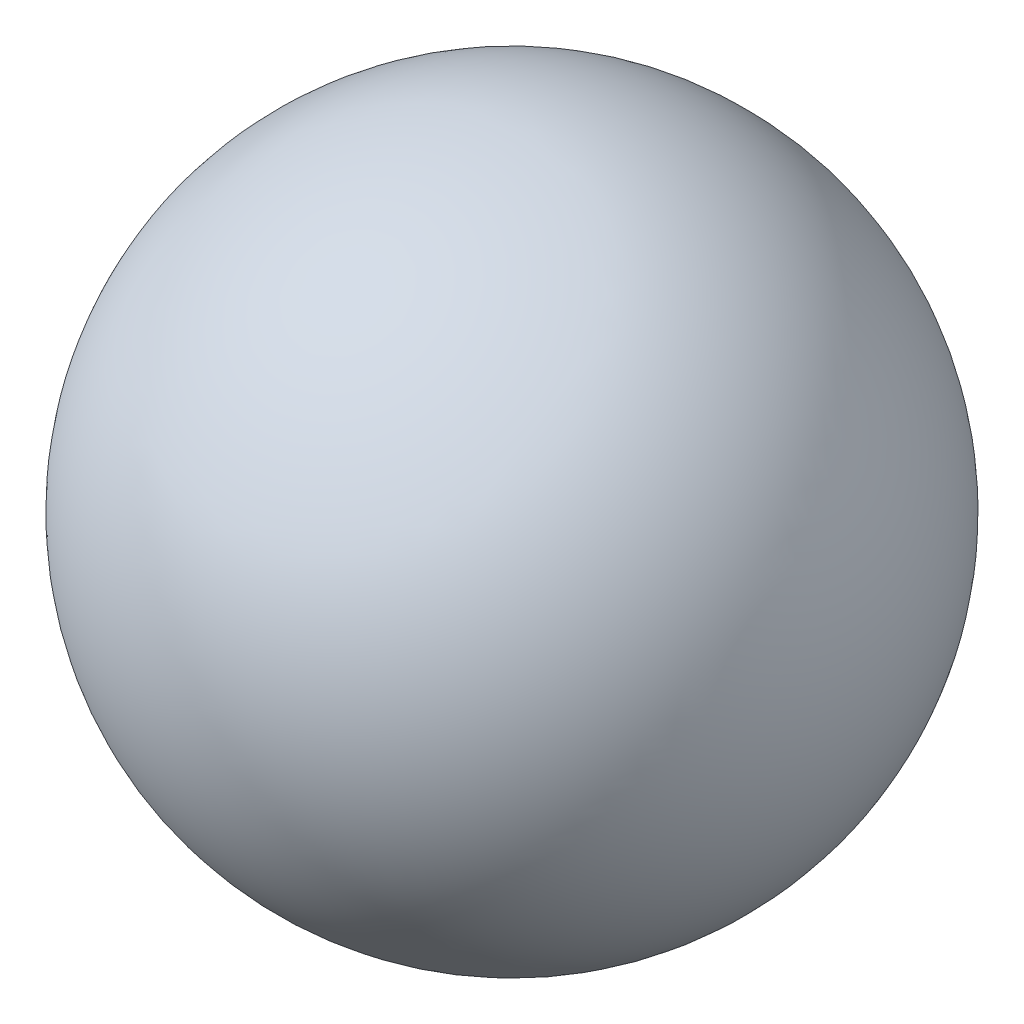
ISO-10303-21;
HEADER;
FILE_DESCRIPTION(('STEP AP214'),'2;1');
FILE_NAME('part.step','',(''),(''),'','','');
FILE_SCHEMA(('AUTOMOTIVE_DESIGN { 1 0 10303 214 1 1 1 1 }'));
ENDSEC;
DATA;
#1=APPLICATION_CONTEXT('core data for automotive mechanical design processes');
#2=APPLICATION_PROTOCOL_DEFINITION('international standard','automotive_design',2000,#1);
#3=PRODUCT_CONTEXT('',#1,'mechanical');
#4=PRODUCT('Part','Part','',(#3));
#5=PRODUCT_RELATED_PRODUCT_CATEGORY('part','',(#4));
#6=PRODUCT_DEFINITION_FORMATION('','',#4);
#7=PRODUCT_DEFINITION_CONTEXT('part definition',#1,'design');
#8=PRODUCT_DEFINITION('design','',#6,#7);
#9=PRODUCT_DEFINITION_SHAPE('','',#8);
#10=(LENGTH_UNIT() NAMED_UNIT(*) SI_UNIT(.MILLI.,.METRE.));
#11=(NAMED_UNIT(*) PLANE_ANGLE_UNIT() SI_UNIT($,.RADIAN.));
#12=(NAMED_UNIT(*) SI_UNIT($,.STERADIAN.) SOLID_ANGLE_UNIT());
#13=UNCERTAINTY_MEASURE_WITH_UNIT(LENGTH_MEASURE(1.E-05),#10,'distance_accuracy_value','');
#14=(GEOMETRIC_REPRESENTATION_CONTEXT(3) GLOBAL_UNCERTAINTY_ASSIGNED_CONTEXT((#13)) GLOBAL_UNIT_ASSIGNED_CONTEXT((#10,
#11,#12)) REPRESENTATION_CONTEXT('',''));
#15=CARTESIAN_POINT('',(0.,0.,0.));
#16=DIRECTION('',(0.,0.,1.));
#17=DIRECTION('',(1.,0.,0.));
#18=AXIS2_PLACEMENT_3D('',#15,#16,#17);
#19=CARTESIAN_POINT('',(0.,0.,0.));
#20=DIRECTION('',(-1.,0.,0.));
#21=DIRECTION('',(0.,1.,0.));
#22=AXIS2_PLACEMENT_3D('',#19,#20,#21);
#23=SPHERICAL_SURFACE('',#22,1.44);
#24=CARTESIAN_POINT('',(-1.44,0.,0.));
#25=VERTEX_POINT('',#24);
#26=VERTEX_LOOP('',#25);
#27=FACE_BOUND('',#26,.T.);
#28=ADVANCED_FACE('F37',(#27),#23,.T.);
#29=CLOSED_SHELL('',(#28));
#30=MANIFOLD_SOLID_BREP('B2',#29);
#31=ADVANCED_BREP_SHAPE_REPRESENTATION('',(#18,#30),#14);
#32=SHAPE_DEFINITION_REPRESENTATION(#9,#31);
ENDSEC;
END-ISO-10303-21;
